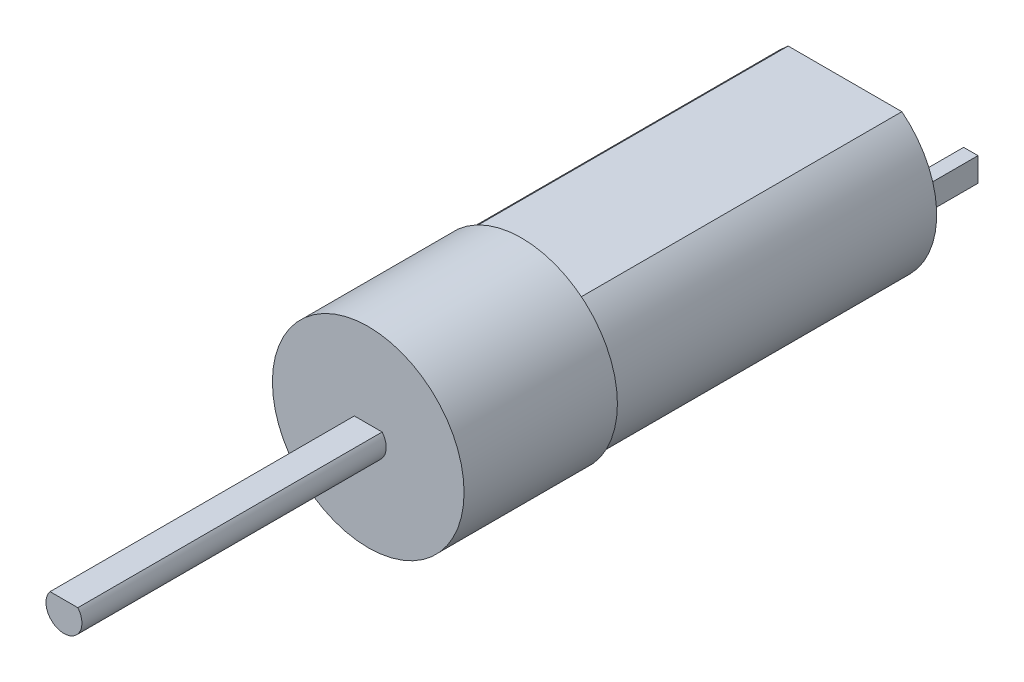
ISO-10303-21;
HEADER;
FILE_DESCRIPTION(('STEP AP214'),'2;1');
FILE_NAME('part.step','',(''),(''),'','','');
FILE_SCHEMA(('AUTOMOTIVE_DESIGN { 1 0 10303 214 1 1 1 1 }'));
ENDSEC;
DATA;
#1=APPLICATION_CONTEXT('core data for automotive mechanical design processes');
#2=APPLICATION_PROTOCOL_DEFINITION('international standard','automotive_design',2000,#1);
#3=PRODUCT_CONTEXT('',#1,'mechanical');
#4=PRODUCT('Part','Part','',(#3));
#5=PRODUCT_RELATED_PRODUCT_CATEGORY('part','',(#4));
#6=PRODUCT_DEFINITION_FORMATION('','',#4);
#7=PRODUCT_DEFINITION_CONTEXT('part definition',#1,'design');
#8=PRODUCT_DEFINITION('design','',#6,#7);
#9=PRODUCT_DEFINITION_SHAPE('','',#8);
#10=(LENGTH_UNIT() NAMED_UNIT(*) SI_UNIT(.MILLI.,.METRE.));
#11=(NAMED_UNIT(*) PLANE_ANGLE_UNIT() SI_UNIT($,.RADIAN.));
#12=(NAMED_UNIT(*) SI_UNIT($,.STERADIAN.) SOLID_ANGLE_UNIT());
#13=UNCERTAINTY_MEASURE_WITH_UNIT(LENGTH_MEASURE(1.E-05),#10,'distance_accuracy_value','');
#14=(GEOMETRIC_REPRESENTATION_CONTEXT(3) GLOBAL_UNCERTAINTY_ASSIGNED_CONTEXT((#13)) GLOBAL_UNIT_ASSIGNED_CONTEXT((#10,
#11,#12)) REPRESENTATION_CONTEXT('',''));
#15=CARTESIAN_POINT('',(0.,0.,0.));
#16=DIRECTION('',(0.,0.,1.));
#17=DIRECTION('',(1.,0.,0.));
#18=AXIS2_PLACEMENT_3D('',#15,#16,#17);
#19=CARTESIAN_POINT('',(0.,0.,-27.));
#20=DIRECTION('',(0.,0.,-1.));
#21=DIRECTION('',(-1.,0.,0.));
#22=AXIS2_PLACEMENT_3D('',#19,#20,#21);
#23=PLANE('',#22);
#24=DIRECTION('',(1.,0.,0.));
#25=VECTOR('',#24,1.);
#26=CARTESIAN_POINT('',(6.1,1.,-27.));
#27=LINE('',#26,#25);
#28=CARTESIAN_POINT('',(4.9,1.,-27.));
#29=VERTEX_POINT('',#28);
#30=CARTESIAN_POINT('',(6.1,1.,-27.));
#31=VERTEX_POINT('',#30);
#32=EDGE_CURVE('E165',#29,#31,#27,.T.);
#33=ORIENTED_EDGE('',*,*,#32,.F.);
#34=DIRECTION('',(0.,1.,0.));
#35=VECTOR('',#34,1.);
#36=CARTESIAN_POINT('',(4.9,-1.,-27.));
#37=LINE('',#36,#35);
#38=CARTESIAN_POINT('',(4.9,-1.,-27.));
#39=VERTEX_POINT('',#38);
#40=EDGE_CURVE('E162',#39,#29,#37,.T.);
#41=ORIENTED_EDGE('',*,*,#40,.F.);
#42=DIRECTION('',(-1.,0.,0.));
#43=VECTOR('',#42,1.);
#44=CARTESIAN_POINT('',(6.1,-1.,-27.));
#45=LINE('',#44,#43);
#46=CARTESIAN_POINT('',(6.1,-1.,-27.));
#47=VERTEX_POINT('',#46);
#48=EDGE_CURVE('E174',#47,#39,#45,.T.);
#49=ORIENTED_EDGE('',*,*,#48,.F.);
#50=DIRECTION('',(0.,-1.,0.));
#51=VECTOR('',#50,1.);
#52=CARTESIAN_POINT('',(6.1,-1.,-27.));
#53=LINE('',#52,#51);
#54=EDGE_CURVE('E182',#31,#47,#53,.T.);
#55=ORIENTED_EDGE('',*,*,#54,.F.);
#56=EDGE_LOOP('',(#33,#41,#49,#55));
#57=FACE_BOUND('',#56,.T.);
#58=DIRECTION('',(1.,0.,0.));
#59=VECTOR('',#58,1.);
#60=CARTESIAN_POINT('',(4.74578760586691,-6.,-27.));
#61=LINE('',#60,#59);
#62=CARTESIAN_POINT('',(-4.74578760586691,-6.,-27.));
#63=VERTEX_POINT('',#62);
#64=CARTESIAN_POINT('',(4.74578760586691,-6.,-27.));
#65=VERTEX_POINT('',#64);
#66=EDGE_CURVE('E208',#63,#65,#61,.T.);
#67=ORIENTED_EDGE('',*,*,#66,.F.);
#68=CARTESIAN_POINT('',(0.,0.,-27.));
#69=DIRECTION('',(0.,0.,-1.));
#70=DIRECTION('',(-1.,0.,0.));
#71=AXIS2_PLACEMENT_3D('',#68,#69,#70);
#72=CIRCLE('',#71,7.65);
#73=CARTESIAN_POINT('',(-4.74578760586691,6.,-27.));
#74=VERTEX_POINT('',#73);
#75=EDGE_CURVE('E228',#63,#74,#72,.T.);
#76=ORIENTED_EDGE('',*,*,#75,.T.);
#77=DIRECTION('',(-1.,0.,0.));
#78=VECTOR('',#77,1.);
#79=CARTESIAN_POINT('',(4.74578760586691,6.,-27.));
#80=LINE('',#79,#78);
#81=CARTESIAN_POINT('',(4.74578760586691,6.,-27.));
#82=VERTEX_POINT('',#81);
#83=EDGE_CURVE('E217',#82,#74,#80,.T.);
#84=ORIENTED_EDGE('',*,*,#83,.F.);
#85=EDGE_CURVE('E230',#82,#65,#72,.T.);
#86=ORIENTED_EDGE('',*,*,#85,.T.);
#87=EDGE_LOOP('',(#67,#76,#84,#86));
#88=FACE_BOUND('',#87,.T.);
#89=DIRECTION('',(1.,0.,0.));
#90=VECTOR('',#89,1.);
#91=CARTESIAN_POINT('',(-6.1,1.,-27.));
#92=LINE('',#91,#90);
#93=CARTESIAN_POINT('',(-6.1,1.,-27.));
#94=VERTEX_POINT('',#93);
#95=CARTESIAN_POINT('',(-4.9,1.,-27.));
#96=VERTEX_POINT('',#95);
#97=EDGE_CURVE('E460',#94,#96,#92,.T.);
#98=ORIENTED_EDGE('',*,*,#97,.F.);
#99=DIRECTION('',(0.,1.,0.));
#100=VECTOR('',#99,1.);
#101=CARTESIAN_POINT('',(-6.1,-1.,-27.));
#102=LINE('',#101,#100);
#103=CARTESIAN_POINT('',(-6.1,-1.,-27.));
#104=VERTEX_POINT('',#103);
#105=EDGE_CURVE('E160',#104,#94,#102,.T.);
#106=ORIENTED_EDGE('',*,*,#105,.F.);
#107=DIRECTION('',(-1.,0.,0.));
#108=VECTOR('',#107,1.);
#109=CARTESIAN_POINT('',(-6.1,-1.,-27.));
#110=LINE('',#109,#108);
#111=CARTESIAN_POINT('',(-4.9,-1.,-27.));
#112=VERTEX_POINT('',#111);
#113=EDGE_CURVE('E156',#112,#104,#110,.T.);
#114=ORIENTED_EDGE('',*,*,#113,.F.);
#115=DIRECTION('',(0.,-1.,0.));
#116=VECTOR('',#115,1.);
#117=CARTESIAN_POINT('',(-4.9,-1.,-27.));
#118=LINE('',#117,#116);
#119=EDGE_CURVE('E457',#96,#112,#118,.T.);
#120=ORIENTED_EDGE('',*,*,#119,.F.);
#121=EDGE_LOOP('',(#98,#106,#114,#120));
#122=FACE_BOUND('',#121,.T.);
#123=ADVANCED_FACE('F35',(#57,#88,#122),#23,.T.);
#124=CARTESIAN_POINT('',(0.,0.,12.8));
#125=DIRECTION('',(0.,0.,1.));
#126=DIRECTION('',(1.,0.,0.));
#127=AXIS2_PLACEMENT_3D('',#124,#125,#126);
#128=PLANE('',#127);
#129=CARTESIAN_POINT('',(0.,0.,12.8));
#130=DIRECTION('',(0.,0.,1.));
#131=DIRECTION('',(1.,0.,0.));
#132=AXIS2_PLACEMENT_3D('',#129,#130,#131);
#133=CIRCLE('',#132,8.);
#134=CARTESIAN_POINT('',(8.,0.,12.8));
#135=VERTEX_POINT('',#134);
#136=EDGE_CURVE('E234',#135,#135,#133,.T.);
#137=ORIENTED_EDGE('',*,*,#136,.T.);
#138=EDGE_LOOP('',(#137));
#139=FACE_BOUND('',#138,.T.);
#140=DIRECTION('',(-1.,0.,0.));
#141=VECTOR('',#140,1.);
#142=CARTESIAN_POINT('',(-1.16081867662439,0.95,12.8));
#143=LINE('',#142,#141);
#144=CARTESIAN_POINT('',(1.16081867662439,0.95,12.8));
#145=VERTEX_POINT('',#144);
#146=CARTESIAN_POINT('',(-1.16081867662439,0.95,12.8));
#147=VERTEX_POINT('',#146);
#148=EDGE_CURVE('E198',#145,#147,#143,.T.);
#149=ORIENTED_EDGE('',*,*,#148,.F.);
#150=CARTESIAN_POINT('',(0.,0.,12.8));
#151=DIRECTION('',(0.,0.,1.));
#152=DIRECTION('',(1.,0.,0.));
#153=AXIS2_PLACEMENT_3D('',#150,#151,#152);
#154=CIRCLE('',#153,1.5);
#155=EDGE_CURVE('E193',#147,#145,#154,.T.);
#156=ORIENTED_EDGE('',*,*,#155,.F.);
#157=EDGE_LOOP('',(#149,#156));
#158=FACE_BOUND('',#157,.T.);
#159=ADVANCED_FACE('F274',(#139,#158),#128,.T.);
#160=CARTESIAN_POINT('',(0.,0.,-27.));
#161=DIRECTION('',(0.,0.,1.));
#162=DIRECTION('',(1.,0.,0.));
#163=AXIS2_PLACEMENT_3D('',#160,#161,#162);
#164=CYLINDRICAL_SURFACE('',#163,7.65);
#165=ORIENTED_EDGE('',*,*,#75,.F.);
#166=DIRECTION('',(0.,0.,-1.));
#167=VECTOR('',#166,1.);
#168=CARTESIAN_POINT('',(-4.74578760586691,-6.,0.));
#169=LINE('',#168,#167);
#170=CARTESIAN_POINT('',(-4.74578760586691,-6.,0.));
#171=VERTEX_POINT('',#170);
#172=EDGE_CURVE('E212',#171,#63,#169,.T.);
#173=ORIENTED_EDGE('',*,*,#172,.F.);
#174=CARTESIAN_POINT('',(0.,0.,0.));
#175=DIRECTION('',(0.,0.,1.));
#176=DIRECTION('',(1.,0.,0.));
#177=AXIS2_PLACEMENT_3D('',#174,#175,#176);
#178=CIRCLE('',#177,7.65);
#179=CARTESIAN_POINT('',(-4.74578760586691,6.,0.));
#180=VERTEX_POINT('',#179);
#181=EDGE_CURVE('E43',#171,#180,#178,.F.);
#182=ORIENTED_EDGE('',*,*,#181,.T.);
#183=DIRECTION('',(0.,0.,-1.));
#184=VECTOR('',#183,1.);
#185=CARTESIAN_POINT('',(-4.74578760586691,6.,0.));
#186=LINE('',#185,#184);
#187=EDGE_CURVE('E225',#180,#74,#186,.T.);
#188=ORIENTED_EDGE('',*,*,#187,.T.);
#189=EDGE_LOOP('',(#165,#173,#182,#188));
#190=FACE_BOUND('',#189,.T.);
#191=ADVANCED_FACE('F243',(#190),#164,.T.);
#192=CARTESIAN_POINT('',(0.,0.,0.));
#193=DIRECTION('',(0.,0.,1.));
#194=DIRECTION('',(1.,0.,0.));
#195=AXIS2_PLACEMENT_3D('',#192,#193,#194);
#196=PLANE('',#195);
#197=CARTESIAN_POINT('',(0.,0.,0.));
#198=DIRECTION('',(0.,0.,1.));
#199=DIRECTION('',(1.,0.,0.));
#200=AXIS2_PLACEMENT_3D('',#197,#198,#199);
#201=CIRCLE('',#200,8.);
#202=CARTESIAN_POINT('',(8.,0.,0.));
#203=VERTEX_POINT('',#202);
#204=EDGE_CURVE('E233',#203,#203,#201,.T.);
#205=ORIENTED_EDGE('',*,*,#204,.F.);
#206=EDGE_LOOP('',(#205));
#207=FACE_BOUND('',#206,.T.);
#208=CARTESIAN_POINT('',(4.74578760586691,6.,0.));
#209=VERTEX_POINT('',#208);
#210=CARTESIAN_POINT('',(4.74578760586691,-6.,0.));
#211=VERTEX_POINT('',#210);
#212=EDGE_CURVE('E11',#209,#211,#178,.F.);
#213=ORIENTED_EDGE('',*,*,#212,.F.);
#214=DIRECTION('',(-1.,0.,0.));
#215=VECTOR('',#214,1.);
#216=CARTESIAN_POINT('',(4.74578760586691,6.,0.));
#217=LINE('',#216,#215);
#218=EDGE_CURVE('E219',#209,#180,#217,.T.);
#219=ORIENTED_EDGE('',*,*,#218,.T.);
#220=ORIENTED_EDGE('',*,*,#181,.F.);
#221=DIRECTION('',(1.,0.,0.));
#222=VECTOR('',#221,1.);
#223=CARTESIAN_POINT('',(4.74578760586691,-6.,0.));
#224=LINE('',#223,#222);
#225=EDGE_CURVE('E209',#171,#211,#224,.T.);
#226=ORIENTED_EDGE('',*,*,#225,.T.);
#227=EDGE_LOOP('',(#213,#219,#220,#226));
#228=FACE_BOUND('',#227,.T.);
#229=ADVANCED_FACE('F240',(#207,#228),#196,.F.);
#230=CARTESIAN_POINT('',(0.,0.,12.8));
#231=DIRECTION('',(0.,0.,-1.));
#232=DIRECTION('',(-1.,0.,0.));
#233=AXIS2_PLACEMENT_3D('',#230,#231,#232);
#234=CYLINDRICAL_SURFACE('',#233,8.);
#235=ORIENTED_EDGE('',*,*,#136,.F.);
#236=EDGE_LOOP('',(#235));
#237=FACE_BOUND('',#236,.T.);
#238=ORIENTED_EDGE('',*,*,#204,.T.);
#239=EDGE_LOOP('',(#238));
#240=FACE_BOUND('',#239,.T.);
#241=ADVANCED_FACE('F37',(#237,#240),#234,.T.);
#242=ORIENTED_EDGE('',*,*,#212,.T.);
#243=DIRECTION('',(0.,0.,-1.));
#244=VECTOR('',#243,1.);
#245=CARTESIAN_POINT('',(4.74578760586691,-6.,0.));
#246=LINE('',#245,#244);
#247=EDGE_CURVE('E214',#211,#65,#246,.T.);
#248=ORIENTED_EDGE('',*,*,#247,.T.);
#249=ORIENTED_EDGE('',*,*,#85,.F.);
#250=DIRECTION('',(0.,0.,-1.));
#251=VECTOR('',#250,1.);
#252=CARTESIAN_POINT('',(4.74578760586691,6.,0.));
#253=LINE('',#252,#251);
#254=EDGE_CURVE('E222',#209,#82,#253,.T.);
#255=ORIENTED_EDGE('',*,*,#254,.F.);
#256=EDGE_LOOP('',(#242,#248,#249,#255));
#257=FACE_BOUND('',#256,.T.);
#258=ADVANCED_FACE('F248',(#257),#164,.T.);
#259=CARTESIAN_POINT('',(4.74578760586691,6.,0.));
#260=DIRECTION('',(0.,-1.,0.));
#261=DIRECTION('',(0.,0.,-1.));
#262=AXIS2_PLACEMENT_3D('',#259,#260,#261);
#263=PLANE('',#262);
#264=ORIENTED_EDGE('',*,*,#83,.T.);
#265=ORIENTED_EDGE('',*,*,#187,.F.);
#266=ORIENTED_EDGE('',*,*,#218,.F.);
#267=ORIENTED_EDGE('',*,*,#254,.T.);
#268=EDGE_LOOP('',(#264,#265,#266,#267));
#269=FACE_BOUND('',#268,.T.);
#270=ADVANCED_FACE('F252',(#269),#263,.F.);
#271=CARTESIAN_POINT('',(4.74578760586691,-6.,0.));
#272=DIRECTION('',(0.,1.,0.));
#273=DIRECTION('',(0.,0.,1.));
#274=AXIS2_PLACEMENT_3D('',#271,#272,#273);
#275=PLANE('',#274);
#276=ORIENTED_EDGE('',*,*,#66,.T.);
#277=ORIENTED_EDGE('',*,*,#247,.F.);
#278=ORIENTED_EDGE('',*,*,#225,.F.);
#279=ORIENTED_EDGE('',*,*,#172,.T.);
#280=EDGE_LOOP('',(#276,#277,#278,#279));
#281=FACE_BOUND('',#280,.T.);
#282=ADVANCED_FACE('F261',(#281),#275,.F.);
#283=CARTESIAN_POINT('',(0.,0.,38.2));
#284=DIRECTION('',(0.,0.,-1.));
#285=DIRECTION('',(-1.,0.,0.));
#286=AXIS2_PLACEMENT_3D('',#283,#284,#285);
#287=CYLINDRICAL_SURFACE('',#286,1.5);
#288=ORIENTED_EDGE('',*,*,#155,.T.);
#289=DIRECTION('',(0.,0.,-1.));
#290=VECTOR('',#289,1.);
#291=CARTESIAN_POINT('',(1.16081867662439,0.95,38.2));
#292=LINE('',#291,#290);
#293=CARTESIAN_POINT('',(1.16081867662439,0.95,38.2));
#294=VERTEX_POINT('',#293);
#295=EDGE_CURVE('E205',#294,#145,#292,.T.);
#296=ORIENTED_EDGE('',*,*,#295,.F.);
#297=CARTESIAN_POINT('',(0.,0.,38.2));
#298=DIRECTION('',(0.,0.,1.));
#299=DIRECTION('',(1.,0.,0.));
#300=AXIS2_PLACEMENT_3D('',#297,#298,#299);
#301=CIRCLE('',#300,1.5);
#302=CARTESIAN_POINT('',(-1.16081867662439,0.95,38.2));
#303=VERTEX_POINT('',#302);
#304=EDGE_CURVE('E194',#303,#294,#301,.T.);
#305=ORIENTED_EDGE('',*,*,#304,.F.);
#306=DIRECTION('',(0.,0.,-1.));
#307=VECTOR('',#306,1.);
#308=CARTESIAN_POINT('',(-1.16081867662439,0.95,38.2));
#309=LINE('',#308,#307);
#310=EDGE_CURVE('E200',#303,#147,#309,.T.);
#311=ORIENTED_EDGE('',*,*,#310,.T.);
#312=EDGE_LOOP('',(#288,#296,#305,#311));
#313=FACE_BOUND('',#312,.T.);
#314=ADVANCED_FACE('F263',(#313),#287,.T.);
#315=CARTESIAN_POINT('',(-1.16081867662439,0.95,38.2));
#316=DIRECTION('',(0.,-1.,0.));
#317=DIRECTION('',(0.,0.,-1.));
#318=AXIS2_PLACEMENT_3D('',#315,#316,#317);
#319=PLANE('',#318);
#320=ORIENTED_EDGE('',*,*,#148,.T.);
#321=ORIENTED_EDGE('',*,*,#310,.F.);
#322=DIRECTION('',(-1.,0.,0.));
#323=VECTOR('',#322,1.);
#324=CARTESIAN_POINT('',(-1.16081867662439,0.95,38.2));
#325=LINE('',#324,#323);
#326=EDGE_CURVE('E197',#294,#303,#325,.T.);
#327=ORIENTED_EDGE('',*,*,#326,.F.);
#328=ORIENTED_EDGE('',*,*,#295,.T.);
#329=EDGE_LOOP('',(#320,#321,#327,#328));
#330=FACE_BOUND('',#329,.T.);
#331=ADVANCED_FACE('F269',(#330),#319,.F.);
#332=CARTESIAN_POINT('',(0.,0.,38.2));
#333=DIRECTION('',(0.,0.,1.));
#334=DIRECTION('',(1.,0.,0.));
#335=AXIS2_PLACEMENT_3D('',#332,#333,#334);
#336=PLANE('',#335);
#337=ORIENTED_EDGE('',*,*,#304,.T.);
#338=ORIENTED_EDGE('',*,*,#326,.T.);
#339=EDGE_LOOP('',(#337,#338));
#340=FACE_BOUND('',#339,.T.);
#341=ADVANCED_FACE('F344',(#340),#336,.T.);
#342=CARTESIAN_POINT('',(4.9,-1.,-32.));
#343=DIRECTION('',(1.,0.,0.));
#344=DIRECTION('',(0.,0.,-1.));
#345=AXIS2_PLACEMENT_3D('',#342,#343,#344);
#346=PLANE('',#345);
#347=ORIENTED_EDGE('',*,*,#40,.T.);
#348=DIRECTION('',(0.,0.,1.));
#349=VECTOR('',#348,1.);
#350=CARTESIAN_POINT('',(4.9,1.,-32.));
#351=LINE('',#350,#349);
#352=CARTESIAN_POINT('',(4.9,1.,-32.));
#353=VERTEX_POINT('',#352);
#354=EDGE_CURVE('E191',#353,#29,#351,.T.);
#355=ORIENTED_EDGE('',*,*,#354,.F.);
#356=DIRECTION('',(0.,1.,0.));
#357=VECTOR('',#356,1.);
#358=CARTESIAN_POINT('',(4.9,-1.,-32.));
#359=LINE('',#358,#357);
#360=CARTESIAN_POINT('',(4.9,-1.,-32.));
#361=VERTEX_POINT('',#360);
#362=EDGE_CURVE('E170',#361,#353,#359,.T.);
#363=ORIENTED_EDGE('',*,*,#362,.F.);
#364=DIRECTION('',(0.,0.,1.));
#365=VECTOR('',#364,1.);
#366=CARTESIAN_POINT('',(4.9,-1.,-32.));
#367=LINE('',#366,#365);
#368=EDGE_CURVE('E179',#361,#39,#367,.T.);
#369=ORIENTED_EDGE('',*,*,#368,.T.);
#370=EDGE_LOOP('',(#347,#355,#363,#369));
#371=FACE_BOUND('',#370,.T.);
#372=ADVANCED_FACE('F353',(#371),#346,.F.);
#373=CARTESIAN_POINT('',(6.1,1.,-32.));
#374=DIRECTION('',(0.,-1.,0.));
#375=DIRECTION('',(0.,0.,-1.));
#376=AXIS2_PLACEMENT_3D('',#373,#374,#375);
#377=PLANE('',#376);
#378=ORIENTED_EDGE('',*,*,#32,.T.);
#379=DIRECTION('',(0.,0.,1.));
#380=VECTOR('',#379,1.);
#381=CARTESIAN_POINT('',(6.1,1.,-32.));
#382=LINE('',#381,#380);
#383=CARTESIAN_POINT('',(6.1,1.,-32.));
#384=VERTEX_POINT('',#383);
#385=EDGE_CURVE('E188',#384,#31,#382,.T.);
#386=ORIENTED_EDGE('',*,*,#385,.F.);
#387=DIRECTION('',(1.,0.,0.));
#388=VECTOR('',#387,1.);
#389=CARTESIAN_POINT('',(6.1,1.,-32.));
#390=LINE('',#389,#388);
#391=EDGE_CURVE('E173',#353,#384,#390,.T.);
#392=ORIENTED_EDGE('',*,*,#391,.F.);
#393=ORIENTED_EDGE('',*,*,#354,.T.);
#394=EDGE_LOOP('',(#378,#386,#392,#393));
#395=FACE_BOUND('',#394,.T.);
#396=ADVANCED_FACE('F368',(#395),#377,.F.);
#397=CARTESIAN_POINT('',(6.1,-1.,-32.));
#398=DIRECTION('',(-1.,0.,0.));
#399=DIRECTION('',(0.,0.,1.));
#400=AXIS2_PLACEMENT_3D('',#397,#398,#399);
#401=PLANE('',#400);
#402=ORIENTED_EDGE('',*,*,#54,.T.);
#403=DIRECTION('',(0.,0.,1.));
#404=VECTOR('',#403,1.);
#405=CARTESIAN_POINT('',(6.1,-1.,-32.));
#406=LINE('',#405,#404);
#407=CARTESIAN_POINT('',(6.1,-1.,-32.));
#408=VERTEX_POINT('',#407);
#409=EDGE_CURVE('E58',#408,#47,#406,.T.);
#410=ORIENTED_EDGE('',*,*,#409,.F.);
#411=DIRECTION('',(0.,-1.,0.));
#412=VECTOR('',#411,1.);
#413=CARTESIAN_POINT('',(6.1,-1.,-32.));
#414=LINE('',#413,#412);
#415=EDGE_CURVE('E176',#384,#408,#414,.T.);
#416=ORIENTED_EDGE('',*,*,#415,.F.);
#417=ORIENTED_EDGE('',*,*,#385,.T.);
#418=EDGE_LOOP('',(#402,#410,#416,#417));
#419=FACE_BOUND('',#418,.T.);
#420=ADVANCED_FACE('F378',(#419),#401,.F.);
#421=CARTESIAN_POINT('',(6.1,-1.,-32.));
#422=DIRECTION('',(0.,1.,0.));
#423=DIRECTION('',(0.,0.,1.));
#424=AXIS2_PLACEMENT_3D('',#421,#422,#423);
#425=PLANE('',#424);
#426=ORIENTED_EDGE('',*,*,#48,.T.);
#427=ORIENTED_EDGE('',*,*,#368,.F.);
#428=DIRECTION('',(-1.,0.,0.));
#429=VECTOR('',#428,1.);
#430=CARTESIAN_POINT('',(6.1,-1.,-32.));
#431=LINE('',#430,#429);
#432=EDGE_CURVE('E178',#408,#361,#431,.T.);
#433=ORIENTED_EDGE('',*,*,#432,.F.);
#434=ORIENTED_EDGE('',*,*,#409,.T.);
#435=EDGE_LOOP('',(#426,#427,#433,#434));
#436=FACE_BOUND('',#435,.T.);
#437=ADVANCED_FACE('F388',(#436),#425,.F.);
#438=CARTESIAN_POINT('',(0.,0.,-32.));
#439=DIRECTION('',(0.,0.,1.));
#440=DIRECTION('',(1.,0.,0.));
#441=AXIS2_PLACEMENT_3D('',#438,#439,#440);
#442=PLANE('',#441);
#443=ORIENTED_EDGE('',*,*,#362,.T.);
#444=ORIENTED_EDGE('',*,*,#391,.T.);
#445=ORIENTED_EDGE('',*,*,#415,.T.);
#446=ORIENTED_EDGE('',*,*,#432,.T.);
#447=EDGE_LOOP('',(#443,#444,#445,#446));
#448=FACE_BOUND('',#447,.T.);
#449=ADVANCED_FACE('F398',(#448),#442,.F.);
#450=CARTESIAN_POINT('',(-6.1,-1.,-32.));
#451=DIRECTION('',(1.,0.,0.));
#452=DIRECTION('',(0.,0.,-1.));
#453=AXIS2_PLACEMENT_3D('',#450,#451,#452);
#454=PLANE('',#453);
#455=ORIENTED_EDGE('',*,*,#105,.T.);
#456=DIRECTION('',(0.,0.,1.));
#457=VECTOR('',#456,1.);
#458=CARTESIAN_POINT('',(-6.1,1.,-32.));
#459=LINE('',#458,#457);
#460=CARTESIAN_POINT('',(-6.1,1.,-32.));
#461=VERTEX_POINT('',#460);
#462=EDGE_CURVE('E141',#461,#94,#459,.T.);
#463=ORIENTED_EDGE('',*,*,#462,.F.);
#464=DIRECTION('',(0.,1.,0.));
#465=VECTOR('',#464,1.);
#466=CARTESIAN_POINT('',(-6.1,-1.,-32.));
#467=LINE('',#466,#465);
#468=CARTESIAN_POINT('',(-6.1,-1.,-32.));
#469=VERTEX_POINT('',#468);
#470=EDGE_CURVE('E148',#469,#461,#467,.T.);
#471=ORIENTED_EDGE('',*,*,#470,.F.);
#472=DIRECTION('',(0.,0.,1.));
#473=VECTOR('',#472,1.);
#474=CARTESIAN_POINT('',(-6.1,-1.,-32.));
#475=LINE('',#474,#473);
#476=EDGE_CURVE('E455',#469,#104,#475,.T.);
#477=ORIENTED_EDGE('',*,*,#476,.T.);
#478=EDGE_LOOP('',(#455,#463,#471,#477));
#479=FACE_BOUND('',#478,.T.);
#480=ADVANCED_FACE('F158',(#479),#454,.F.);
#481=CARTESIAN_POINT('',(-6.1,1.,-32.));
#482=DIRECTION('',(0.,-1.,0.));
#483=DIRECTION('',(0.,0.,-1.));
#484=AXIS2_PLACEMENT_3D('',#481,#482,#483);
#485=PLANE('',#484);
#486=ORIENTED_EDGE('',*,*,#97,.T.);
#487=DIRECTION('',(0.,0.,1.));
#488=VECTOR('',#487,1.);
#489=CARTESIAN_POINT('',(-4.9,1.,-32.));
#490=LINE('',#489,#488);
#491=CARTESIAN_POINT('',(-4.9,1.,-32.));
#492=VERTEX_POINT('',#491);
#493=EDGE_CURVE('E144',#492,#96,#490,.T.);
#494=ORIENTED_EDGE('',*,*,#493,.F.);
#495=DIRECTION('',(1.,0.,0.));
#496=VECTOR('',#495,1.);
#497=CARTESIAN_POINT('',(-6.1,1.,-32.));
#498=LINE('',#497,#496);
#499=EDGE_CURVE('E137',#461,#492,#498,.T.);
#500=ORIENTED_EDGE('',*,*,#499,.F.);
#501=ORIENTED_EDGE('',*,*,#462,.T.);
#502=EDGE_LOOP('',(#486,#494,#500,#501));
#503=FACE_BOUND('',#502,.T.);
#504=ADVANCED_FACE('F139',(#503),#485,.F.);
#505=CARTESIAN_POINT('',(-4.9,-1.,-32.));
#506=DIRECTION('',(-1.,0.,0.));
#507=DIRECTION('',(0.,0.,1.));
#508=AXIS2_PLACEMENT_3D('',#505,#506,#507);
#509=PLANE('',#508);
#510=ORIENTED_EDGE('',*,*,#119,.T.);
#511=DIRECTION('',(0.,0.,1.));
#512=VECTOR('',#511,1.);
#513=CARTESIAN_POINT('',(-4.9,-1.,-32.));
#514=LINE('',#513,#512);
#515=CARTESIAN_POINT('',(-4.9,-1.,-32.));
#516=VERTEX_POINT('',#515);
#517=EDGE_CURVE('E50',#516,#112,#514,.T.);
#518=ORIENTED_EDGE('',*,*,#517,.F.);
#519=DIRECTION('',(0.,-1.,0.));
#520=VECTOR('',#519,1.);
#521=CARTESIAN_POINT('',(-4.9,-1.,-32.));
#522=LINE('',#521,#520);
#523=EDGE_CURVE('E147',#492,#516,#522,.T.);
#524=ORIENTED_EDGE('',*,*,#523,.F.);
#525=ORIENTED_EDGE('',*,*,#493,.T.);
#526=EDGE_LOOP('',(#510,#518,#524,#525));
#527=FACE_BOUND('',#526,.T.);
#528=ADVANCED_FACE('F424',(#527),#509,.F.);
#529=CARTESIAN_POINT('',(-6.1,-1.,-32.));
#530=DIRECTION('',(0.,1.,0.));
#531=DIRECTION('',(0.,0.,1.));
#532=AXIS2_PLACEMENT_3D('',#529,#530,#531);
#533=PLANE('',#532);
#534=ORIENTED_EDGE('',*,*,#113,.T.);
#535=ORIENTED_EDGE('',*,*,#476,.F.);
#536=DIRECTION('',(-1.,0.,0.));
#537=VECTOR('',#536,1.);
#538=CARTESIAN_POINT('',(-6.1,-1.,-32.));
#539=LINE('',#538,#537);
#540=EDGE_CURVE('E152',#516,#469,#539,.T.);
#541=ORIENTED_EDGE('',*,*,#540,.F.);
#542=ORIENTED_EDGE('',*,*,#517,.T.);
#543=EDGE_LOOP('',(#534,#535,#541,#542));
#544=FACE_BOUND('',#543,.T.);
#545=ADVANCED_FACE('F433',(#544),#533,.F.);
#546=CARTESIAN_POINT('',(0.,0.,-32.));
#547=DIRECTION('',(0.,0.,-1.));
#548=DIRECTION('',(-1.,0.,0.));
#549=AXIS2_PLACEMENT_3D('',#546,#547,#548);
#550=PLANE('',#549);
#551=ORIENTED_EDGE('',*,*,#470,.T.);
#552=ORIENTED_EDGE('',*,*,#499,.T.);
#553=ORIENTED_EDGE('',*,*,#523,.T.);
#554=ORIENTED_EDGE('',*,*,#540,.T.);
#555=EDGE_LOOP('',(#551,#552,#553,#554));
#556=FACE_BOUND('',#555,.T.);
#557=ADVANCED_FACE('F151',(#556),#550,.T.);
#558=CLOSED_SHELL('',(#123,#159,#191,#229,#241,#258,#270,#282,#314,#331,#341,#372,#396,#420,
#437,#449,#480,#504,#528,#545,#557));
#559=MANIFOLD_SOLID_BREP('B2',#558);
#560=ADVANCED_BREP_SHAPE_REPRESENTATION('',(#18,#559),#14);
#561=SHAPE_DEFINITION_REPRESENTATION(#9,#560);
ENDSEC;
END-ISO-10303-21;
